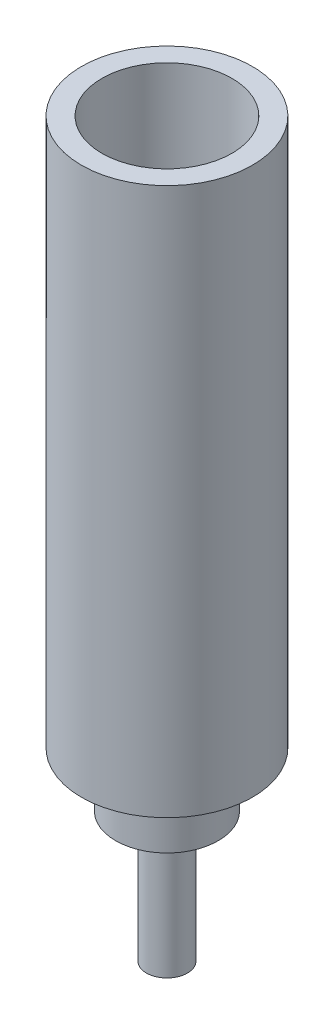
ISO-10303-21;
HEADER;
FILE_DESCRIPTION(('STEP AP214'),'2;1');
FILE_NAME('part.step','',(''),(''),'','','');
FILE_SCHEMA(('AUTOMOTIVE_DESIGN { 1 0 10303 214 1 1 1 1 }'));
ENDSEC;
DATA;
#1=APPLICATION_CONTEXT('core data for automotive mechanical design processes');
#2=APPLICATION_PROTOCOL_DEFINITION('international standard','automotive_design',2000,#1);
#3=PRODUCT_CONTEXT('',#1,'mechanical');
#4=PRODUCT('Part','Part','',(#3));
#5=PRODUCT_RELATED_PRODUCT_CATEGORY('part','',(#4));
#6=PRODUCT_DEFINITION_FORMATION('','',#4);
#7=PRODUCT_DEFINITION_CONTEXT('part definition',#1,'design');
#8=PRODUCT_DEFINITION('design','',#6,#7);
#9=PRODUCT_DEFINITION_SHAPE('','',#8);
#10=(LENGTH_UNIT() NAMED_UNIT(*) SI_UNIT(.MILLI.,.METRE.));
#11=(NAMED_UNIT(*) PLANE_ANGLE_UNIT() SI_UNIT($,.RADIAN.));
#12=(NAMED_UNIT(*) SI_UNIT($,.STERADIAN.) SOLID_ANGLE_UNIT());
#13=UNCERTAINTY_MEASURE_WITH_UNIT(LENGTH_MEASURE(1.E-05),#10,'distance_accuracy_value','');
#14=(GEOMETRIC_REPRESENTATION_CONTEXT(3) GLOBAL_UNCERTAINTY_ASSIGNED_CONTEXT((#13)) GLOBAL_UNIT_ASSIGNED_CONTEXT((#10,
#11,#12)) REPRESENTATION_CONTEXT('',''));
#15=CARTESIAN_POINT('',(0.,0.,0.));
#16=DIRECTION('',(0.,0.,1.));
#17=DIRECTION('',(1.,0.,0.));
#18=AXIS2_PLACEMENT_3D('',#15,#16,#17);
#19=CARTESIAN_POINT('',(-3.,0.,0.));
#20=DIRECTION('',(0.,-1.,0.));
#21=DIRECTION('',(0.,0.,-1.));
#22=AXIS2_PLACEMENT_3D('',#19,#20,#21);
#23=PLANE('',#22);
#24=CARTESIAN_POINT('',(0.,0.,0.));
#25=DIRECTION('',(0.,1.,0.));
#26=DIRECTION('',(0.,0.,1.));
#27=AXIS2_PLACEMENT_3D('',#24,#25,#26);
#28=CIRCLE('',#27,3.);
#29=CARTESIAN_POINT('',(0.,0.,3.));
#30=VERTEX_POINT('',#29);
#31=EDGE_CURVE('E10',#30,#30,#28,.T.);
#32=ORIENTED_EDGE('',*,*,#31,.F.);
#33=EDGE_LOOP('',(#32));
#34=FACE_BOUND('',#33,.T.);
#35=ADVANCED_FACE('F31',(#34),#23,.T.);
#36=CARTESIAN_POINT('',(0.,98.3499768795762,0.));
#37=DIRECTION('',(0.,1.,0.));
#38=DIRECTION('',(0.,0.,1.));
#39=AXIS2_PLACEMENT_3D('',#36,#37,#38);
#40=CYLINDRICAL_SURFACE('',#39,2.99999999999999);
#41=ORIENTED_EDGE('',*,*,#31,.T.);
#42=EDGE_LOOP('',(#41));
#43=FACE_BOUND('',#42,.T.);
#44=CARTESIAN_POINT('',(0.,19.,0.));
#45=DIRECTION('',(0.,1.,0.));
#46=DIRECTION('',(0.,0.,1.));
#47=AXIS2_PLACEMENT_3D('',#44,#45,#46);
#48=CIRCLE('',#47,2.99999999999999);
#49=CARTESIAN_POINT('',(0.,19.,2.99999999999999));
#50=VERTEX_POINT('',#49);
#51=EDGE_CURVE('E37',#50,#50,#48,.T.);
#52=ORIENTED_EDGE('',*,*,#51,.F.);
#53=EDGE_LOOP('',(#52));
#54=FACE_BOUND('',#53,.T.);
#55=ADVANCED_FACE('F79',(#43,#54),#40,.T.);
#56=CARTESIAN_POINT('',(-7.49999999999999,19.,0.));
#57=DIRECTION('',(0.,-1.,0.));
#58=DIRECTION('',(0.,0.,-1.));
#59=AXIS2_PLACEMENT_3D('',#56,#57,#58);
#60=PLANE('',#59);
#61=ORIENTED_EDGE('',*,*,#51,.T.);
#62=EDGE_LOOP('',(#61));
#63=FACE_BOUND('',#62,.T.);
#64=CARTESIAN_POINT('',(0.,19.,0.));
#65=DIRECTION('',(0.,1.,0.));
#66=DIRECTION('',(0.,0.,1.));
#67=AXIS2_PLACEMENT_3D('',#64,#65,#66);
#68=CIRCLE('',#67,7.49999999999999);
#69=CARTESIAN_POINT('',(0.,19.,7.49999999999999));
#70=VERTEX_POINT('',#69);
#71=EDGE_CURVE('E41',#70,#70,#68,.T.);
#72=ORIENTED_EDGE('',*,*,#71,.F.);
#73=EDGE_LOOP('',(#72));
#74=FACE_BOUND('',#73,.T.);
#75=ADVANCED_FACE('F84',(#63,#74),#60,.T.);
#76=CARTESIAN_POINT('',(0.,98.3499768795762,0.));
#77=DIRECTION('',(0.,1.,0.));
#78=DIRECTION('',(0.,0.,1.));
#79=AXIS2_PLACEMENT_3D('',#76,#77,#78);
#80=CYLINDRICAL_SURFACE('',#79,7.49999999999999);
#81=ORIENTED_EDGE('',*,*,#71,.T.);
#82=EDGE_LOOP('',(#81));
#83=FACE_BOUND('',#82,.T.);
#84=CARTESIAN_POINT('',(0.,27.,0.));
#85=DIRECTION('',(0.,1.,0.));
#86=DIRECTION('',(0.,0.,1.));
#87=AXIS2_PLACEMENT_3D('',#84,#85,#86);
#88=CIRCLE('',#87,7.49999999999999);
#89=CARTESIAN_POINT('',(0.,27.,7.49999999999999));
#90=VERTEX_POINT('',#89);
#91=EDGE_CURVE('E45',#90,#90,#88,.T.);
#92=ORIENTED_EDGE('',*,*,#91,.F.);
#93=EDGE_LOOP('',(#92));
#94=FACE_BOUND('',#93,.T.);
#95=ADVANCED_FACE('F88',(#83,#94),#80,.T.);
#96=CARTESIAN_POINT('',(-12.5,27.,0.));
#97=DIRECTION('',(0.,-1.,0.));
#98=DIRECTION('',(0.,0.,-1.));
#99=AXIS2_PLACEMENT_3D('',#96,#97,#98);
#100=PLANE('',#99);
#101=ORIENTED_EDGE('',*,*,#91,.T.);
#102=EDGE_LOOP('',(#101));
#103=FACE_BOUND('',#102,.T.);
#104=CARTESIAN_POINT('',(0.,27.,0.));
#105=DIRECTION('',(0.,1.,0.));
#106=DIRECTION('',(0.,0.,1.));
#107=AXIS2_PLACEMENT_3D('',#104,#105,#106);
#108=CIRCLE('',#107,12.5);
#109=CARTESIAN_POINT('',(0.,27.,12.5));
#110=VERTEX_POINT('',#109);
#111=EDGE_CURVE('E50',#110,#110,#108,.T.);
#112=ORIENTED_EDGE('',*,*,#111,.F.);
#113=EDGE_LOOP('',(#112));
#114=FACE_BOUND('',#113,.T.);
#115=ADVANCED_FACE('F94',(#103,#114),#100,.T.);
#116=CARTESIAN_POINT('',(0.,98.3499768795762,0.));
#117=DIRECTION('',(0.,1.,0.));
#118=DIRECTION('',(0.,0.,1.));
#119=AXIS2_PLACEMENT_3D('',#116,#117,#118);
#120=CYLINDRICAL_SURFACE('',#119,12.5);
#121=ORIENTED_EDGE('',*,*,#111,.T.);
#122=EDGE_LOOP('',(#121));
#123=FACE_BOUND('',#122,.T.);
#124=CARTESIAN_POINT('',(0.,107.,0.));
#125=DIRECTION('',(0.,1.,0.));
#126=DIRECTION('',(0.,0.,1.));
#127=AXIS2_PLACEMENT_3D('',#124,#125,#126);
#128=CIRCLE('',#127,12.5);
#129=CARTESIAN_POINT('',(0.,107.,12.5));
#130=VERTEX_POINT('',#129);
#131=EDGE_CURVE('E53',#130,#130,#128,.T.);
#132=ORIENTED_EDGE('',*,*,#131,.F.);
#133=EDGE_LOOP('',(#132));
#134=FACE_BOUND('',#133,.T.);
#135=ADVANCED_FACE('F75',(#123,#134),#120,.T.);
#136=CARTESIAN_POINT('',(-9.5,107.,0.));
#137=DIRECTION('',(0.,1.,0.));
#138=DIRECTION('',(0.,0.,1.));
#139=AXIS2_PLACEMENT_3D('',#136,#137,#138);
#140=PLANE('',#139);
#141=ORIENTED_EDGE('',*,*,#131,.T.);
#142=EDGE_LOOP('',(#141));
#143=FACE_BOUND('',#142,.T.);
#144=CARTESIAN_POINT('',(0.,107.,0.));
#145=DIRECTION('',(0.,1.,0.));
#146=DIRECTION('',(0.,0.,1.));
#147=AXIS2_PLACEMENT_3D('',#144,#145,#146);
#148=CIRCLE('',#147,9.5);
#149=CARTESIAN_POINT('',(0.,107.,9.5));
#150=VERTEX_POINT('',#149);
#151=EDGE_CURVE('E56',#150,#150,#148,.T.);
#152=ORIENTED_EDGE('',*,*,#151,.F.);
#153=EDGE_LOOP('',(#152));
#154=FACE_BOUND('',#153,.T.);
#155=ADVANCED_FACE('F67',(#143,#154),#140,.T.);
#156=CARTESIAN_POINT('',(0.,98.3499768795762,0.));
#157=DIRECTION('',(0.,1.,0.));
#158=DIRECTION('',(0.,0.,1.));
#159=AXIS2_PLACEMENT_3D('',#156,#157,#158);
#160=CYLINDRICAL_SURFACE('',#159,9.5);
#161=ORIENTED_EDGE('',*,*,#151,.T.);
#162=EDGE_LOOP('',(#161));
#163=FACE_BOUND('',#162,.T.);
#164=CARTESIAN_POINT('',(0.,32.,0.));
#165=DIRECTION('',(0.,1.,0.));
#166=DIRECTION('',(0.,0.,1.));
#167=AXIS2_PLACEMENT_3D('',#164,#165,#166);
#168=CIRCLE('',#167,9.49999999999999);
#169=CARTESIAN_POINT('',(0.,32.,9.49999999999999));
#170=VERTEX_POINT('',#169);
#171=EDGE_CURVE('E59',#170,#170,#168,.T.);
#172=ORIENTED_EDGE('',*,*,#171,.F.);
#173=EDGE_LOOP('',(#172));
#174=FACE_BOUND('',#173,.T.);
#175=ADVANCED_FACE('F65',(#163,#174),#160,.F.);
#176=CARTESIAN_POINT('',(-9.49999999999999,32.,0.));
#177=DIRECTION('',(0.,1.,0.));
#178=DIRECTION('',(0.,0.,1.));
#179=AXIS2_PLACEMENT_3D('',#176,#177,#178);
#180=PLANE('',#179);
#181=ORIENTED_EDGE('',*,*,#171,.T.);
#182=EDGE_LOOP('',(#181));
#183=FACE_BOUND('',#182,.T.);
#184=ADVANCED_FACE('F63',(#183),#180,.T.);
#185=CLOSED_SHELL('',(#35,#55,#75,#95,#115,#135,#155,#175,#184));
#186=MANIFOLD_SOLID_BREP('B2',#185);
#187=ADVANCED_BREP_SHAPE_REPRESENTATION('',(#18,#186),#14);
#188=SHAPE_DEFINITION_REPRESENTATION(#9,#187);
ENDSEC;
END-ISO-10303-21;
